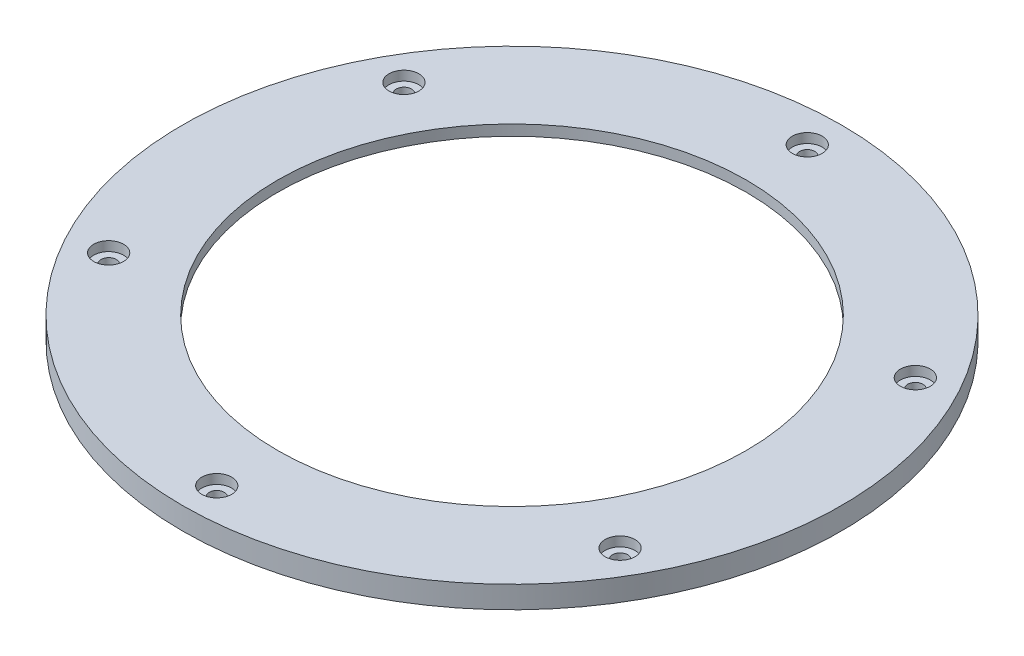
ISO-10303-21;
HEADER;
FILE_DESCRIPTION(('STEP AP214'),'2;1');
FILE_NAME('part.step','',(''),(''),'','','');
FILE_SCHEMA(('AUTOMOTIVE_DESIGN { 1 0 10303 214 1 1 1 1 }'));
ENDSEC;
DATA;
#1=APPLICATION_CONTEXT('core data for automotive mechanical design processes');
#2=APPLICATION_PROTOCOL_DEFINITION('international standard','automotive_design',2000,#1);
#3=PRODUCT_CONTEXT('',#1,'mechanical');
#4=PRODUCT('Part','Part','',(#3));
#5=PRODUCT_RELATED_PRODUCT_CATEGORY('part','',(#4));
#6=PRODUCT_DEFINITION_FORMATION('','',#4);
#7=PRODUCT_DEFINITION_CONTEXT('part definition',#1,'design');
#8=PRODUCT_DEFINITION('design','',#6,#7);
#9=PRODUCT_DEFINITION_SHAPE('','',#8);
#10=(LENGTH_UNIT() NAMED_UNIT(*) SI_UNIT(.MILLI.,.METRE.));
#11=(NAMED_UNIT(*) PLANE_ANGLE_UNIT() SI_UNIT($,.RADIAN.));
#12=(NAMED_UNIT(*) SI_UNIT($,.STERADIAN.) SOLID_ANGLE_UNIT());
#13=UNCERTAINTY_MEASURE_WITH_UNIT(LENGTH_MEASURE(1.E-05),#10,'distance_accuracy_value','');
#14=(GEOMETRIC_REPRESENTATION_CONTEXT(3) GLOBAL_UNCERTAINTY_ASSIGNED_CONTEXT((#13)) GLOBAL_UNIT_ASSIGNED_CONTEXT((#10,
#11,#12)) REPRESENTATION_CONTEXT('',''));
#15=CARTESIAN_POINT('',(0.,0.,0.));
#16=DIRECTION('',(0.,0.,1.));
#17=DIRECTION('',(1.,0.,0.));
#18=AXIS2_PLACEMENT_3D('',#15,#16,#17);
#19=CARTESIAN_POINT('',(0.,5.8,0.));
#20=DIRECTION('',(0.,-1.,0.));
#21=DIRECTION('',(0.,0.,-1.));
#22=AXIS2_PLACEMENT_3D('',#19,#20,#21);
#23=CYLINDRICAL_SURFACE('',#22,61.5);
#24=CARTESIAN_POINT('',(0.,5.8,0.));
#25=DIRECTION('',(0.,1.,0.));
#26=DIRECTION('',(0.,0.,1.));
#27=AXIS2_PLACEMENT_3D('',#24,#25,#26);
#28=CIRCLE('',#27,61.5);
#29=CARTESIAN_POINT('',(0.,5.8,61.5));
#30=VERTEX_POINT('',#29);
#31=EDGE_CURVE('E52',#30,#30,#28,.T.);
#32=ORIENTED_EDGE('',*,*,#31,.T.);
#33=EDGE_LOOP('',(#32));
#34=FACE_BOUND('',#33,.T.);
#35=CARTESIAN_POINT('',(0.,3.,0.));
#36=DIRECTION('',(0.,-1.,0.));
#37=DIRECTION('',(0.,0.,-1.));
#38=AXIS2_PLACEMENT_3D('',#35,#36,#37);
#39=CIRCLE('',#38,61.5);
#40=CARTESIAN_POINT('',(0.,3.,-61.5));
#41=VERTEX_POINT('',#40);
#42=EDGE_CURVE('E61',#41,#41,#39,.T.);
#43=ORIENTED_EDGE('',*,*,#42,.T.);
#44=EDGE_LOOP('',(#43));
#45=FACE_BOUND('',#44,.T.);
#46=ADVANCED_FACE('F37',(#34,#45),#23,.F.);
#47=CARTESIAN_POINT('',(0.,5.8,0.));
#48=DIRECTION('',(0.,1.,0.));
#49=DIRECTION('',(0.,0.,1.));
#50=AXIS2_PLACEMENT_3D('',#47,#48,#49);
#51=PLANE('',#50);
#52=CARTESIAN_POINT('',(2.74780198594726E-12,5.8,77.4999999999979));
#53=DIRECTION('',(0.,1.,0.));
#54=DIRECTION('',(0.,0.,1.));
#55=AXIS2_PLACEMENT_3D('',#52,#53,#54);
#56=CIRCLE('',#55,3.925);
#57=CARTESIAN_POINT('',(2.74780198594726E-12,5.8,81.4249999999979));
#58=VERTEX_POINT('',#57);
#59=EDGE_CURVE('E264',#58,#58,#56,.T.);
#60=ORIENTED_EDGE('',*,*,#59,.F.);
#61=EDGE_LOOP('',(#60));
#62=FACE_BOUND('',#61,.T.);
#63=CARTESIAN_POINT('',(67.1169687932937,5.8,38.7499999999964));
#64=DIRECTION('',(0.,1.,0.));
#65=DIRECTION('',(0.,0.,1.));
#66=AXIS2_PLACEMENT_3D('',#63,#64,#65);
#67=CIRCLE('',#66,3.925);
#68=CARTESIAN_POINT('',(67.1169687932937,5.8,42.6749999999964));
#69=VERTEX_POINT('',#68);
#70=EDGE_CURVE('E84',#69,#69,#67,.T.);
#71=ORIENTED_EDGE('',*,*,#70,.F.);
#72=EDGE_LOOP('',(#71));
#73=FACE_BOUND('',#72,.T.);
#74=CARTESIAN_POINT('',(67.1169687932904,5.8,-38.7500000000021));
#75=DIRECTION('',(0.,1.,0.));
#76=DIRECTION('',(0.,0.,1.));
#77=AXIS2_PLACEMENT_3D('',#74,#75,#76);
#78=CIRCLE('',#77,3.925);
#79=CARTESIAN_POINT('',(67.1169687932904,5.8,-34.8250000000021));
#80=VERTEX_POINT('',#79);
#81=EDGE_CURVE('E79',#80,#80,#78,.T.);
#82=ORIENTED_EDGE('',*,*,#81,.F.);
#83=EDGE_LOOP('',(#82));
#84=FACE_BOUND('',#83,.T.);
#85=CARTESIAN_POINT('',(-3.29597460435593E-12,5.8,-77.4999999999979));
#86=DIRECTION('',(0.,1.,0.));
#87=DIRECTION('',(0.,0.,1.));
#88=AXIS2_PLACEMENT_3D('',#85,#86,#87);
#89=CIRCLE('',#88,3.925);
#90=CARTESIAN_POINT('',(-3.29597460435593E-12,5.8,-73.5749999999979));
#91=VERTEX_POINT('',#90);
#92=EDGE_CURVE('E74',#91,#91,#89,.T.);
#93=ORIENTED_EDGE('',*,*,#92,.F.);
#94=EDGE_LOOP('',(#93));
#95=FACE_BOUND('',#94,.T.);
#96=CARTESIAN_POINT('',(-67.1169687932939,5.8,-38.749999999996));
#97=DIRECTION('',(0.,1.,0.));
#98=DIRECTION('',(0.,0.,1.));
#99=AXIS2_PLACEMENT_3D('',#96,#97,#98);
#100=CIRCLE('',#99,3.925);
#101=CARTESIAN_POINT('',(-67.1169687932939,5.8,-34.824999999996));
#102=VERTEX_POINT('',#101);
#103=EDGE_CURVE('E68',#102,#102,#100,.T.);
#104=ORIENTED_EDGE('',*,*,#103,.F.);
#105=EDGE_LOOP('',(#104));
#106=FACE_BOUND('',#105,.T.);
#107=CARTESIAN_POINT('',(-67.1169687932904,5.8,38.7500000000021));
#108=DIRECTION('',(0.,1.,0.));
#109=DIRECTION('',(0.,0.,1.));
#110=AXIS2_PLACEMENT_3D('',#107,#108,#109);
#111=CIRCLE('',#110,3.925);
#112=CARTESIAN_POINT('',(-67.1169687932904,5.8,42.6750000000021));
#113=VERTEX_POINT('',#112);
#114=EDGE_CURVE('E62',#113,#113,#111,.T.);
#115=ORIENTED_EDGE('',*,*,#114,.F.);
#116=EDGE_LOOP('',(#115));
#117=FACE_BOUND('',#116,.T.);
#118=CARTESIAN_POINT('',(0.,5.8,0.));
#119=DIRECTION('',(0.,1.,0.));
#120=DIRECTION('',(0.,0.,1.));
#121=AXIS2_PLACEMENT_3D('',#118,#119,#120);
#122=CIRCLE('',#121,86.5);
#123=CARTESIAN_POINT('',(0.,5.8,86.5));
#124=VERTEX_POINT('',#123);
#125=EDGE_CURVE('E10',#124,#124,#122,.T.);
#126=ORIENTED_EDGE('',*,*,#125,.T.);
#127=EDGE_LOOP('',(#126));
#128=FACE_BOUND('',#127,.T.);
#129=ORIENTED_EDGE('',*,*,#31,.F.);
#130=EDGE_LOOP('',(#129));
#131=FACE_BOUND('',#130,.T.);
#132=ADVANCED_FACE('F163',(#62,#73,#84,#95,#106,#117,#128,#131),#51,.T.);
#133=CARTESIAN_POINT('',(0.,0.,0.));
#134=DIRECTION('',(0.,1.,0.));
#135=DIRECTION('',(0.,0.,1.));
#136=AXIS2_PLACEMENT_3D('',#133,#134,#135);
#137=PLANE('',#136);
#138=CARTESIAN_POINT('',(0.,0.,0.));
#139=DIRECTION('',(0.,-1.,0.));
#140=DIRECTION('',(0.,0.,-1.));
#141=AXIS2_PLACEMENT_3D('',#138,#139,#140);
#142=CIRCLE('',#141,70.);
#143=CARTESIAN_POINT('',(0.,0.,-70.));
#144=VERTEX_POINT('',#143);
#145=EDGE_CURVE('E125',#144,#144,#142,.T.);
#146=ORIENTED_EDGE('',*,*,#145,.F.);
#147=EDGE_LOOP('',(#146));
#148=FACE_BOUND('',#147,.T.);
#149=CARTESIAN_POINT('',(0.,0.,0.));
#150=DIRECTION('',(0.,1.,0.));
#151=DIRECTION('',(0.,0.,1.));
#152=AXIS2_PLACEMENT_3D('',#149,#150,#151);
#153=CIRCLE('',#152,86.5);
#154=CARTESIAN_POINT('',(0.,0.,86.5));
#155=VERTEX_POINT('',#154);
#156=EDGE_CURVE('E46',#155,#155,#153,.T.);
#157=ORIENTED_EDGE('',*,*,#156,.F.);
#158=EDGE_LOOP('',(#157));
#159=FACE_BOUND('',#158,.T.);
#160=CARTESIAN_POINT('',(0.,0.,-77.5));
#161=DIRECTION('',(0.,1.,0.));
#162=DIRECTION('',(0.,0.,1.));
#163=AXIS2_PLACEMENT_3D('',#160,#161,#162);
#164=CIRCLE('',#163,2.00000000000001);
#165=CARTESIAN_POINT('',(0.,0.,-75.5));
#166=VERTEX_POINT('',#165);
#167=EDGE_CURVE('E152',#166,#166,#164,.T.);
#168=ORIENTED_EDGE('',*,*,#167,.T.);
#169=EDGE_LOOP('',(#168));
#170=FACE_BOUND('',#169,.T.);
#171=CARTESIAN_POINT('',(67.1169687932952,0.,-38.7500000000021));
#172=DIRECTION('',(0.,1.,0.));
#173=DIRECTION('',(0.,0.,1.));
#174=AXIS2_PLACEMENT_3D('',#171,#172,#173);
#175=CIRCLE('',#174,2.);
#176=CARTESIAN_POINT('',(67.1169687932952,0.,-36.7500000000021));
#177=VERTEX_POINT('',#176);
#178=EDGE_CURVE('E149',#177,#177,#175,.T.);
#179=ORIENTED_EDGE('',*,*,#178,.T.);
#180=EDGE_LOOP('',(#179));
#181=FACE_BOUND('',#180,.T.);
#182=CARTESIAN_POINT('',(67.1169687932976,0.,38.7499999999979));
#183=DIRECTION('',(0.,1.,0.));
#184=DIRECTION('',(0.,0.,1.));
#185=AXIS2_PLACEMENT_3D('',#182,#183,#184);
#186=CIRCLE('',#185,1.99999999999998);
#187=CARTESIAN_POINT('',(67.1169687932976,0.,40.7499999999979));
#188=VERTEX_POINT('',#187);
#189=EDGE_CURVE('E145',#188,#188,#186,.T.);
#190=ORIENTED_EDGE('',*,*,#189,.T.);
#191=EDGE_LOOP('',(#190));
#192=FACE_BOUND('',#191,.T.);
#193=CARTESIAN_POINT('',(4.82556736917295E-12,0.,77.5));
#194=DIRECTION('',(0.,1.,0.));
#195=DIRECTION('',(0.,0.,1.));
#196=AXIS2_PLACEMENT_3D('',#193,#194,#195);
#197=CIRCLE('',#196,2.00000000000001);
#198=CARTESIAN_POINT('',(4.82556736917295E-12,0.,79.5));
#199=VERTEX_POINT('',#198);
#200=EDGE_CURVE('E141',#199,#199,#197,.T.);
#201=ORIENTED_EDGE('',*,*,#200,.T.);
#202=EDGE_LOOP('',(#201));
#203=FACE_BOUND('',#202,.T.);
#204=CARTESIAN_POINT('',(-67.1169687932904,0.,38.7500000000021));
#205=DIRECTION('',(0.,1.,0.));
#206=DIRECTION('',(0.,0.,1.));
#207=AXIS2_PLACEMENT_3D('',#204,#205,#206);
#208=CIRCLE('',#207,2.);
#209=CARTESIAN_POINT('',(-67.1169687932904,0.,40.7500000000021));
#210=VERTEX_POINT('',#209);
#211=EDGE_CURVE('E137',#210,#210,#208,.T.);
#212=ORIENTED_EDGE('',*,*,#211,.T.);
#213=EDGE_LOOP('',(#212));
#214=FACE_BOUND('',#213,.T.);
#215=CARTESIAN_POINT('',(-67.1169687932928,0.,-38.7499999999979));
#216=DIRECTION('',(0.,1.,0.));
#217=DIRECTION('',(0.,0.,1.));
#218=AXIS2_PLACEMENT_3D('',#215,#216,#217);
#219=CIRCLE('',#218,2.);
#220=CARTESIAN_POINT('',(-67.1169687932928,0.,-36.7499999999979));
#221=VERTEX_POINT('',#220);
#222=EDGE_CURVE('E130',#221,#221,#219,.T.);
#223=ORIENTED_EDGE('',*,*,#222,.T.);
#224=EDGE_LOOP('',(#223));
#225=FACE_BOUND('',#224,.T.);
#226=ADVANCED_FACE('F165',(#148,#159,#170,#181,#192,#203,#214,#225),#137,.F.);
#227=CARTESIAN_POINT('',(0.,5.8,0.));
#228=DIRECTION('',(0.,-1.,0.));
#229=DIRECTION('',(0.,0.,-1.));
#230=AXIS2_PLACEMENT_3D('',#227,#228,#229);
#231=CYLINDRICAL_SURFACE('',#230,86.5);
#232=ORIENTED_EDGE('',*,*,#125,.F.);
#233=EDGE_LOOP('',(#232));
#234=FACE_BOUND('',#233,.T.);
#235=ORIENTED_EDGE('',*,*,#156,.T.);
#236=EDGE_LOOP('',(#235));
#237=FACE_BOUND('',#236,.T.);
#238=ADVANCED_FACE('F39',(#234,#237),#231,.T.);
#239=CARTESIAN_POINT('',(0.,5.8,-77.5));
#240=DIRECTION('',(0.,-1.,0.));
#241=DIRECTION('',(0.,0.,-1.));
#242=AXIS2_PLACEMENT_3D('',#239,#240,#241);
#243=CYLINDRICAL_SURFACE('',#242,2.00000000000001);
#244=CARTESIAN_POINT('',(0.,3.3,-77.5));
#245=DIRECTION('',(0.,-1.,0.));
#246=DIRECTION('',(0.,0.,-1.));
#247=AXIS2_PLACEMENT_3D('',#244,#245,#246);
#248=CIRCLE('',#247,2.00000000000001);
#249=CARTESIAN_POINT('',(0.,3.3,-79.5));
#250=VERTEX_POINT('',#249);
#251=EDGE_CURVE('E69',#250,#250,#248,.T.);
#252=ORIENTED_EDGE('',*,*,#251,.F.);
#253=EDGE_LOOP('',(#252));
#254=FACE_BOUND('',#253,.T.);
#255=ORIENTED_EDGE('',*,*,#167,.F.);
#256=EDGE_LOOP('',(#255));
#257=FACE_BOUND('',#256,.T.);
#258=ADVANCED_FACE('F177',(#254,#257),#243,.F.);
#259=CARTESIAN_POINT('',(67.1169687932952,5.8,-38.7500000000021));
#260=DIRECTION('',(0.,-1.,0.));
#261=DIRECTION('',(0.,0.,-1.));
#262=AXIS2_PLACEMENT_3D('',#259,#260,#261);
#263=CYLINDRICAL_SURFACE('',#262,2.);
#264=CARTESIAN_POINT('',(67.1169687932952,3.3,-38.7500000000021));
#265=DIRECTION('',(0.,-1.,0.));
#266=DIRECTION('',(0.,0.,-1.));
#267=AXIS2_PLACEMENT_3D('',#264,#265,#266);
#268=CIRCLE('',#267,2.);
#269=CARTESIAN_POINT('',(67.1169687932952,3.3,-40.7500000000021));
#270=VERTEX_POINT('',#269);
#271=EDGE_CURVE('E75',#270,#270,#268,.T.);
#272=ORIENTED_EDGE('',*,*,#271,.F.);
#273=EDGE_LOOP('',(#272));
#274=FACE_BOUND('',#273,.T.);
#275=ORIENTED_EDGE('',*,*,#178,.F.);
#276=EDGE_LOOP('',(#275));
#277=FACE_BOUND('',#276,.T.);
#278=ADVANCED_FACE('F180',(#274,#277),#263,.F.);
#279=CARTESIAN_POINT('',(67.1169687932976,5.8,38.7499999999979));
#280=DIRECTION('',(0.,-1.,0.));
#281=DIRECTION('',(0.,0.,-1.));
#282=AXIS2_PLACEMENT_3D('',#279,#280,#281);
#283=CYLINDRICAL_SURFACE('',#282,1.99999999999998);
#284=CARTESIAN_POINT('',(67.1169687932976,3.3,38.7499999999979));
#285=DIRECTION('',(0.,-1.,0.));
#286=DIRECTION('',(0.,0.,-1.));
#287=AXIS2_PLACEMENT_3D('',#284,#285,#286);
#288=CIRCLE('',#287,1.99999999999998);
#289=CARTESIAN_POINT('',(67.1169687932976,3.3,36.7499999999979));
#290=VERTEX_POINT('',#289);
#291=EDGE_CURVE('E80',#290,#290,#288,.T.);
#292=ORIENTED_EDGE('',*,*,#291,.F.);
#293=EDGE_LOOP('',(#292));
#294=FACE_BOUND('',#293,.T.);
#295=ORIENTED_EDGE('',*,*,#189,.F.);
#296=EDGE_LOOP('',(#295));
#297=FACE_BOUND('',#296,.T.);
#298=ADVANCED_FACE('F184',(#294,#297),#283,.F.);
#299=CARTESIAN_POINT('',(4.82556736917295E-12,5.8,77.5));
#300=DIRECTION('',(0.,-1.,0.));
#301=DIRECTION('',(0.,0.,-1.));
#302=AXIS2_PLACEMENT_3D('',#299,#300,#301);
#303=CYLINDRICAL_SURFACE('',#302,2.00000000000001);
#304=CARTESIAN_POINT('',(4.82556736917295E-12,3.3,77.5));
#305=DIRECTION('',(0.,-1.,0.));
#306=DIRECTION('',(0.,0.,-1.));
#307=AXIS2_PLACEMENT_3D('',#304,#305,#306);
#308=CIRCLE('',#307,2.00000000000001);
#309=CARTESIAN_POINT('',(4.82556736917295E-12,3.3,75.5));
#310=VERTEX_POINT('',#309);
#311=EDGE_CURVE('E41',#310,#310,#308,.T.);
#312=ORIENTED_EDGE('',*,*,#311,.F.);
#313=EDGE_LOOP('',(#312));
#314=FACE_BOUND('',#313,.T.);
#315=ORIENTED_EDGE('',*,*,#200,.F.);
#316=EDGE_LOOP('',(#315));
#317=FACE_BOUND('',#316,.T.);
#318=ADVANCED_FACE('F188',(#314,#317),#303,.F.);
#319=CARTESIAN_POINT('',(-67.1169687932904,5.8,38.7500000000021));
#320=DIRECTION('',(0.,-1.,0.));
#321=DIRECTION('',(0.,0.,-1.));
#322=AXIS2_PLACEMENT_3D('',#319,#320,#321);
#323=CYLINDRICAL_SURFACE('',#322,2.);
#324=CARTESIAN_POINT('',(-67.1169687932904,3.3,38.7500000000021));
#325=DIRECTION('',(0.,-1.,0.));
#326=DIRECTION('',(0.,0.,-1.));
#327=AXIS2_PLACEMENT_3D('',#324,#325,#326);
#328=CIRCLE('',#327,2.);
#329=CARTESIAN_POINT('',(-67.1169687932904,3.3,36.7500000000021));
#330=VERTEX_POINT('',#329);
#331=EDGE_CURVE('E57',#330,#330,#328,.T.);
#332=ORIENTED_EDGE('',*,*,#331,.F.);
#333=EDGE_LOOP('',(#332));
#334=FACE_BOUND('',#333,.T.);
#335=ORIENTED_EDGE('',*,*,#211,.F.);
#336=EDGE_LOOP('',(#335));
#337=FACE_BOUND('',#336,.T.);
#338=ADVANCED_FACE('F192',(#334,#337),#323,.F.);
#339=CARTESIAN_POINT('',(-67.1169687932928,5.8,-38.7499999999979));
#340=DIRECTION('',(0.,-1.,0.));
#341=DIRECTION('',(0.,0.,-1.));
#342=AXIS2_PLACEMENT_3D('',#339,#340,#341);
#343=CYLINDRICAL_SURFACE('',#342,2.);
#344=CARTESIAN_POINT('',(-67.1169687932928,3.3,-38.7499999999979));
#345=DIRECTION('',(0.,-1.,0.));
#346=DIRECTION('',(0.,0.,-1.));
#347=AXIS2_PLACEMENT_3D('',#344,#345,#346);
#348=CIRCLE('',#347,2.);
#349=CARTESIAN_POINT('',(-67.1169687932928,3.3,-40.7499999999979));
#350=VERTEX_POINT('',#349);
#351=EDGE_CURVE('E63',#350,#350,#348,.T.);
#352=ORIENTED_EDGE('',*,*,#351,.F.);
#353=EDGE_LOOP('',(#352));
#354=FACE_BOUND('',#353,.T.);
#355=ORIENTED_EDGE('',*,*,#222,.F.);
#356=EDGE_LOOP('',(#355));
#357=FACE_BOUND('',#356,.T.);
#358=ADVANCED_FACE('F196',(#354,#357),#343,.F.);
#359=CARTESIAN_POINT('',(0.,3.,0.));
#360=DIRECTION('',(0.,-1.,0.));
#361=DIRECTION('',(0.,0.,-1.));
#362=AXIS2_PLACEMENT_3D('',#359,#360,#361);
#363=CYLINDRICAL_SURFACE('',#362,70.);
#364=CARTESIAN_POINT('',(0.,3.,0.));
#365=DIRECTION('',(0.,-1.,0.));
#366=DIRECTION('',(0.,0.,-1.));
#367=AXIS2_PLACEMENT_3D('',#364,#365,#366);
#368=CIRCLE('',#367,70.);
#369=CARTESIAN_POINT('',(0.,3.,-70.));
#370=VERTEX_POINT('',#369);
#371=EDGE_CURVE('E126',#370,#370,#368,.T.);
#372=ORIENTED_EDGE('',*,*,#371,.F.);
#373=EDGE_LOOP('',(#372));
#374=FACE_BOUND('',#373,.T.);
#375=ORIENTED_EDGE('',*,*,#145,.T.);
#376=EDGE_LOOP('',(#375));
#377=FACE_BOUND('',#376,.T.);
#378=ADVANCED_FACE('F200',(#374,#377),#363,.F.);
#379=CARTESIAN_POINT('',(0.,3.,0.));
#380=DIRECTION('',(0.,-1.,0.));
#381=DIRECTION('',(0.,0.,-1.));
#382=AXIS2_PLACEMENT_3D('',#379,#380,#381);
#383=PLANE('',#382);
#384=ORIENTED_EDGE('',*,*,#42,.F.);
#385=EDGE_LOOP('',(#384));
#386=FACE_BOUND('',#385,.T.);
#387=ORIENTED_EDGE('',*,*,#371,.T.);
#388=EDGE_LOOP('',(#387));
#389=FACE_BOUND('',#388,.T.);
#390=ADVANCED_FACE('F204',(#386,#389),#383,.T.);
#391=CARTESIAN_POINT('',(-67.1169687932904,5.8,38.7500000000021));
#392=DIRECTION('',(0.,1.,0.));
#393=DIRECTION('',(0.,0.,1.));
#394=AXIS2_PLACEMENT_3D('',#391,#392,#393);
#395=CYLINDRICAL_SURFACE('',#394,3.925);
#396=CARTESIAN_POINT('',(-67.1169687932904,3.3,38.7500000000021));
#397=DIRECTION('',(0.,1.,0.));
#398=DIRECTION('',(0.,0.,1.));
#399=AXIS2_PLACEMENT_3D('',#396,#397,#398);
#400=CIRCLE('',#399,3.925);
#401=CARTESIAN_POINT('',(-67.1169687932904,3.3,42.6750000000021));
#402=VERTEX_POINT('',#401);
#403=EDGE_CURVE('E67',#402,#402,#400,.T.);
#404=ORIENTED_EDGE('',*,*,#403,.F.);
#405=EDGE_LOOP('',(#404));
#406=FACE_BOUND('',#405,.T.);
#407=ORIENTED_EDGE('',*,*,#114,.T.);
#408=EDGE_LOOP('',(#407));
#409=FACE_BOUND('',#408,.T.);
#410=ADVANCED_FACE('F208',(#406,#409),#395,.F.);
#411=CARTESIAN_POINT('',(-63.1919687932904,3.3,38.7500000000021));
#412=DIRECTION('',(0.,-1.,0.));
#413=DIRECTION('',(0.,0.,-1.));
#414=AXIS2_PLACEMENT_3D('',#411,#412,#413);
#415=PLANE('',#414);
#416=ORIENTED_EDGE('',*,*,#331,.T.);
#417=EDGE_LOOP('',(#416));
#418=FACE_BOUND('',#417,.T.);
#419=ORIENTED_EDGE('',*,*,#403,.T.);
#420=EDGE_LOOP('',(#419));
#421=FACE_BOUND('',#420,.T.);
#422=ADVANCED_FACE('F212',(#418,#421),#415,.F.);
#423=CARTESIAN_POINT('',(-67.1169687932939,5.8,-38.749999999996));
#424=DIRECTION('',(0.,1.,0.));
#425=DIRECTION('',(0.,0.,1.));
#426=AXIS2_PLACEMENT_3D('',#423,#424,#425);
#427=CYLINDRICAL_SURFACE('',#426,3.925);
#428=CARTESIAN_POINT('',(-67.1169687932939,3.3,-38.749999999996));
#429=DIRECTION('',(0.,1.,0.));
#430=DIRECTION('',(0.,0.,1.));
#431=AXIS2_PLACEMENT_3D('',#428,#429,#430);
#432=CIRCLE('',#431,3.925);
#433=CARTESIAN_POINT('',(-67.1169687932939,3.3,-34.824999999996));
#434=VERTEX_POINT('',#433);
#435=EDGE_CURVE('E73',#434,#434,#432,.T.);
#436=ORIENTED_EDGE('',*,*,#435,.F.);
#437=EDGE_LOOP('',(#436));
#438=FACE_BOUND('',#437,.T.);
#439=ORIENTED_EDGE('',*,*,#103,.T.);
#440=EDGE_LOOP('',(#439));
#441=FACE_BOUND('',#440,.T.);
#442=ADVANCED_FACE('F216',(#438,#441),#427,.F.);
#443=CARTESIAN_POINT('',(-63.1919687932939,3.3,-38.749999999996));
#444=DIRECTION('',(0.,-1.,0.));
#445=DIRECTION('',(0.,0.,-1.));
#446=AXIS2_PLACEMENT_3D('',#443,#444,#445);
#447=PLANE('',#446);
#448=ORIENTED_EDGE('',*,*,#351,.T.);
#449=EDGE_LOOP('',(#448));
#450=FACE_BOUND('',#449,.T.);
#451=ORIENTED_EDGE('',*,*,#435,.T.);
#452=EDGE_LOOP('',(#451));
#453=FACE_BOUND('',#452,.T.);
#454=ADVANCED_FACE('F220',(#450,#453),#447,.F.);
#455=CARTESIAN_POINT('',(-3.29597460435593E-12,5.8,-77.4999999999979));
#456=DIRECTION('',(0.,1.,0.));
#457=DIRECTION('',(0.,0.,1.));
#458=AXIS2_PLACEMENT_3D('',#455,#456,#457);
#459=CYLINDRICAL_SURFACE('',#458,3.925);
#460=CARTESIAN_POINT('',(-3.29597460435593E-12,3.3,-77.4999999999979));
#461=DIRECTION('',(0.,1.,0.));
#462=DIRECTION('',(0.,0.,1.));
#463=AXIS2_PLACEMENT_3D('',#460,#461,#462);
#464=CIRCLE('',#463,3.925);
#465=CARTESIAN_POINT('',(-3.29597460435593E-12,3.3,-73.5749999999979));
#466=VERTEX_POINT('',#465);
#467=EDGE_CURVE('E78',#466,#466,#464,.T.);
#468=ORIENTED_EDGE('',*,*,#467,.F.);
#469=EDGE_LOOP('',(#468));
#470=FACE_BOUND('',#469,.T.);
#471=ORIENTED_EDGE('',*,*,#92,.T.);
#472=EDGE_LOOP('',(#471));
#473=FACE_BOUND('',#472,.T.);
#474=ADVANCED_FACE('F224',(#470,#473),#459,.F.);
#475=CARTESIAN_POINT('',(3.9249999999967,3.3,-77.4999999999979));
#476=DIRECTION('',(0.,-1.,0.));
#477=DIRECTION('',(0.,0.,-1.));
#478=AXIS2_PLACEMENT_3D('',#475,#476,#477);
#479=PLANE('',#478);
#480=ORIENTED_EDGE('',*,*,#251,.T.);
#481=EDGE_LOOP('',(#480));
#482=FACE_BOUND('',#481,.T.);
#483=ORIENTED_EDGE('',*,*,#467,.T.);
#484=EDGE_LOOP('',(#483));
#485=FACE_BOUND('',#484,.T.);
#486=ADVANCED_FACE('F228',(#482,#485),#479,.F.);
#487=CARTESIAN_POINT('',(67.1169687932904,5.8,-38.7500000000021));
#488=DIRECTION('',(0.,1.,0.));
#489=DIRECTION('',(0.,0.,1.));
#490=AXIS2_PLACEMENT_3D('',#487,#488,#489);
#491=CYLINDRICAL_SURFACE('',#490,3.925);
#492=CARTESIAN_POINT('',(67.1169687932904,3.3,-38.7500000000021));
#493=DIRECTION('',(0.,1.,0.));
#494=DIRECTION('',(0.,0.,1.));
#495=AXIS2_PLACEMENT_3D('',#492,#493,#494);
#496=CIRCLE('',#495,3.925);
#497=CARTESIAN_POINT('',(67.1169687932904,3.3,-34.8250000000021));
#498=VERTEX_POINT('',#497);
#499=EDGE_CURVE('E83',#498,#498,#496,.T.);
#500=ORIENTED_EDGE('',*,*,#499,.F.);
#501=EDGE_LOOP('',(#500));
#502=FACE_BOUND('',#501,.T.);
#503=ORIENTED_EDGE('',*,*,#81,.T.);
#504=EDGE_LOOP('',(#503));
#505=FACE_BOUND('',#504,.T.);
#506=ADVANCED_FACE('F232',(#502,#505),#491,.F.);
#507=CARTESIAN_POINT('',(71.0419687932904,3.3,-38.7500000000021));
#508=DIRECTION('',(0.,-1.,0.));
#509=DIRECTION('',(0.,0.,-1.));
#510=AXIS2_PLACEMENT_3D('',#507,#508,#509);
#511=PLANE('',#510);
#512=ORIENTED_EDGE('',*,*,#271,.T.);
#513=EDGE_LOOP('',(#512));
#514=FACE_BOUND('',#513,.T.);
#515=ORIENTED_EDGE('',*,*,#499,.T.);
#516=EDGE_LOOP('',(#515));
#517=FACE_BOUND('',#516,.T.);
#518=ADVANCED_FACE('F236',(#514,#517),#511,.F.);
#519=CARTESIAN_POINT('',(67.1169687932937,5.8,38.7499999999964));
#520=DIRECTION('',(0.,1.,0.));
#521=DIRECTION('',(0.,0.,1.));
#522=AXIS2_PLACEMENT_3D('',#519,#520,#521);
#523=CYLINDRICAL_SURFACE('',#522,3.925);
#524=CARTESIAN_POINT('',(67.1169687932937,3.3,38.7499999999964));
#525=DIRECTION('',(0.,1.,0.));
#526=DIRECTION('',(0.,0.,1.));
#527=AXIS2_PLACEMENT_3D('',#524,#525,#526);
#528=CIRCLE('',#527,3.925);
#529=CARTESIAN_POINT('',(67.1169687932937,3.3,42.6749999999964));
#530=VERTEX_POINT('',#529);
#531=EDGE_CURVE('E92',#530,#530,#528,.T.);
#532=ORIENTED_EDGE('',*,*,#531,.F.);
#533=EDGE_LOOP('',(#532));
#534=FACE_BOUND('',#533,.T.);
#535=ORIENTED_EDGE('',*,*,#70,.T.);
#536=EDGE_LOOP('',(#535));
#537=FACE_BOUND('',#536,.T.);
#538=ADVANCED_FACE('F240',(#534,#537),#523,.F.);
#539=CARTESIAN_POINT('',(71.0419687932936,3.3,38.7499999999964));
#540=DIRECTION('',(0.,-1.,0.));
#541=DIRECTION('',(0.,0.,-1.));
#542=AXIS2_PLACEMENT_3D('',#539,#540,#541);
#543=PLANE('',#542);
#544=ORIENTED_EDGE('',*,*,#291,.T.);
#545=EDGE_LOOP('',(#544));
#546=FACE_BOUND('',#545,.T.);
#547=ORIENTED_EDGE('',*,*,#531,.T.);
#548=EDGE_LOOP('',(#547));
#549=FACE_BOUND('',#548,.T.);
#550=ADVANCED_FACE('F244',(#546,#549),#543,.F.);
#551=CARTESIAN_POINT('',(2.74780198594726E-12,5.8,77.4999999999979));
#552=DIRECTION('',(0.,1.,0.));
#553=DIRECTION('',(0.,0.,1.));
#554=AXIS2_PLACEMENT_3D('',#551,#552,#553);
#555=CYLINDRICAL_SURFACE('',#554,3.925);
#556=CARTESIAN_POINT('',(2.74780198594726E-12,3.3,77.4999999999979));
#557=DIRECTION('',(0.,1.,0.));
#558=DIRECTION('',(0.,0.,1.));
#559=AXIS2_PLACEMENT_3D('',#556,#557,#558);
#560=CIRCLE('',#559,3.925);
#561=CARTESIAN_POINT('',(2.74780198594726E-12,3.3,81.4249999999979));
#562=VERTEX_POINT('',#561);
#563=EDGE_CURVE('E262',#562,#562,#560,.T.);
#564=ORIENTED_EDGE('',*,*,#563,.F.);
#565=EDGE_LOOP('',(#564));
#566=FACE_BOUND('',#565,.T.);
#567=ORIENTED_EDGE('',*,*,#59,.T.);
#568=EDGE_LOOP('',(#567));
#569=FACE_BOUND('',#568,.T.);
#570=ADVANCED_FACE('F248',(#566,#569),#555,.F.);
#571=CARTESIAN_POINT('',(3.92500000000275,3.3,77.4999999999979));
#572=DIRECTION('',(0.,-1.,0.));
#573=DIRECTION('',(0.,0.,-1.));
#574=AXIS2_PLACEMENT_3D('',#571,#572,#573);
#575=PLANE('',#574);
#576=ORIENTED_EDGE('',*,*,#311,.T.);
#577=EDGE_LOOP('',(#576));
#578=FACE_BOUND('',#577,.T.);
#579=ORIENTED_EDGE('',*,*,#563,.T.);
#580=EDGE_LOOP('',(#579));
#581=FACE_BOUND('',#580,.T.);
#582=ADVANCED_FACE('F251',(#578,#581),#575,.F.);
#583=CLOSED_SHELL('',(#46,#132,#226,#238,#258,#278,#298,#318,#338,#358,#378,#390,#410,#422,#442,
#454,#474,#486,#506,#518,#538,#550,#570,#582));
#584=MANIFOLD_SOLID_BREP('B2',#583);
#585=ADVANCED_BREP_SHAPE_REPRESENTATION('',(#18,#584),#14);
#586=SHAPE_DEFINITION_REPRESENTATION(#9,#585);
ENDSEC;
END-ISO-10303-21;
